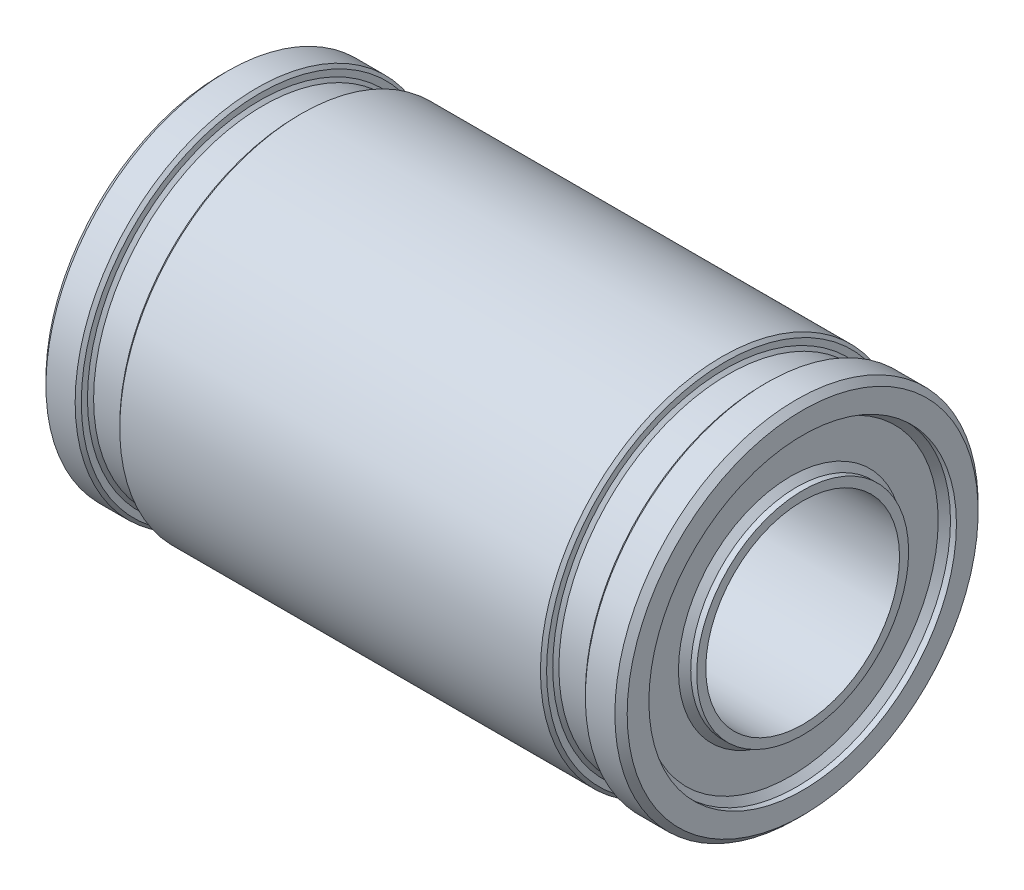
ISO-10303-21;
HEADER;
FILE_DESCRIPTION(('STEP AP214'),'2;1');
FILE_NAME('part.step','',(''),(''),'','','');
FILE_SCHEMA(('AUTOMOTIVE_DESIGN { 1 0 10303 214 1 1 1 1 }'));
ENDSEC;
DATA;
#1=APPLICATION_CONTEXT('core data for automotive mechanical design processes');
#2=APPLICATION_PROTOCOL_DEFINITION('international standard','automotive_design',2000,#1);
#3=PRODUCT_CONTEXT('',#1,'mechanical');
#4=PRODUCT('Part','Part','',(#3));
#5=PRODUCT_RELATED_PRODUCT_CATEGORY('part','',(#4));
#6=PRODUCT_DEFINITION_FORMATION('','',#4);
#7=PRODUCT_DEFINITION_CONTEXT('part definition',#1,'design');
#8=PRODUCT_DEFINITION('design','',#6,#7);
#9=PRODUCT_DEFINITION_SHAPE('','',#8);
#10=(LENGTH_UNIT() NAMED_UNIT(*) SI_UNIT(.MILLI.,.METRE.));
#11=(NAMED_UNIT(*) PLANE_ANGLE_UNIT() SI_UNIT($,.RADIAN.));
#12=(NAMED_UNIT(*) SI_UNIT($,.STERADIAN.) SOLID_ANGLE_UNIT());
#13=UNCERTAINTY_MEASURE_WITH_UNIT(LENGTH_MEASURE(1.E-05),#10,'distance_accuracy_value','');
#14=(GEOMETRIC_REPRESENTATION_CONTEXT(3) GLOBAL_UNCERTAINTY_ASSIGNED_CONTEXT((#13)) GLOBAL_UNIT_ASSIGNED_CONTEXT((#10,
#11,#12)) REPRESENTATION_CONTEXT('',''));
#15=CARTESIAN_POINT('',(0.,0.,0.));
#16=DIRECTION('',(0.,0.,1.));
#17=DIRECTION('',(1.,0.,0.));
#18=AXIS2_PLACEMENT_3D('',#15,#16,#17);
#19=CARTESIAN_POINT('',(24.,6.92500000000001,0.));
#20=DIRECTION('',(1.,0.,0.));
#21=DIRECTION('',(0.,0.,-1.));
#22=AXIS2_PLACEMENT_3D('',#19,#20,#21);
#23=PLANE('',#22);
#24=CARTESIAN_POINT('',(24.,0.,0.));
#25=DIRECTION('',(1.,0.,0.));
#26=DIRECTION('',(0.,0.,-1.));
#27=AXIS2_PLACEMENT_3D('',#24,#25,#26);
#28=CIRCLE('',#27,6.35);
#29=CARTESIAN_POINT('',(24.,0.,-6.35));
#30=VERTEX_POINT('',#29);
#31=EDGE_CURVE('E104',#30,#30,#28,.T.);
#32=ORIENTED_EDGE('',*,*,#31,.F.);
#33=EDGE_LOOP('',(#32));
#34=FACE_BOUND('',#33,.T.);
#35=CARTESIAN_POINT('',(24.0000000017015,0.,0.));
#36=DIRECTION('',(-1.,0.,0.));
#37=DIRECTION('',(0.,0.,1.));
#38=AXIS2_PLACEMENT_3D('',#35,#36,#37);
#39=CIRCLE('',#38,7.24600000170147);
#40=CARTESIAN_POINT('',(24.0000000017015,0.,7.24600000170147));
#41=VERTEX_POINT('',#40);
#42=EDGE_CURVE('E18',#41,#41,#39,.T.);
#43=ORIENTED_EDGE('',*,*,#42,.F.);
#44=EDGE_LOOP('',(#43));
#45=FACE_BOUND('',#44,.T.);
#46=ADVANCED_FACE('F15',(#34,#45),#23,.T.);
#47=CARTESIAN_POINT('',(24.0000000017015,0.,0.));
#48=DIRECTION('',(-1.,0.,0.));
#49=DIRECTION('',(0.,0.,1.));
#50=AXIS2_PLACEMENT_3D('',#47,#48,#49);
#51=CONICAL_SURFACE('',#50,7.24600000170147,0.785398150000003);
#52=ORIENTED_EDGE('',*,*,#42,.T.);
#53=EDGE_LOOP('',(#52));
#54=FACE_BOUND('',#53,.T.);
#55=CARTESIAN_POINT('',(23.746,0.,0.));
#56=DIRECTION('',(1.,0.,0.));
#57=DIRECTION('',(0.,1.,0.));
#58=AXIS2_PLACEMENT_3D('',#55,#56,#57);
#59=CIRCLE('',#58,7.5);
#60=CARTESIAN_POINT('',(23.746,7.5,0.));
#61=VERTEX_POINT('',#60);
#62=EDGE_CURVE('E99',#61,#61,#59,.F.);
#63=ORIENTED_EDGE('',*,*,#62,.F.);
#64=EDGE_LOOP('',(#63));
#65=FACE_BOUND('',#64,.T.);
#66=ADVANCED_FACE('F153',(#54,#65),#51,.T.);
#67=CARTESIAN_POINT('',(23.754,0.,0.));
#68=DIRECTION('',(1.,0.,0.));
#69=DIRECTION('',(0.,0.,-1.));
#70=AXIS2_PLACEMENT_3D('',#67,#68,#69);
#71=CYLINDRICAL_SURFACE('',#70,6.35);
#72=CARTESIAN_POINT('',(23.754,0.,0.));
#73=DIRECTION('',(1.,0.,0.));
#74=DIRECTION('',(0.,-1.,0.));
#75=AXIS2_PLACEMENT_3D('',#72,#73,#74);
#76=CIRCLE('',#75,6.35);
#77=CARTESIAN_POINT('',(23.754,-6.35,0.));
#78=VERTEX_POINT('',#77);
#79=EDGE_CURVE('E94',#78,#78,#76,.T.);
#80=ORIENTED_EDGE('',*,*,#79,.F.);
#81=EDGE_LOOP('',(#80));
#82=FACE_BOUND('',#81,.T.);
#83=ORIENTED_EDGE('',*,*,#31,.T.);
#84=EDGE_LOOP('',(#83));
#85=FACE_BOUND('',#84,.T.);
#86=ADVANCED_FACE('F164',(#82,#85),#71,.F.);
#87=CARTESIAN_POINT('',(22.5268,0.,0.));
#88=DIRECTION('',(1.,0.,0.));
#89=DIRECTION('',(0.,0.,-1.));
#90=AXIS2_PLACEMENT_3D('',#87,#88,#89);
#91=CYLINDRICAL_SURFACE('',#90,7.5);
#92=CARTESIAN_POINT('',(22.5268000008508,0.,0.));
#93=DIRECTION('',(1.,0.,0.));
#94=DIRECTION('',(0.,-1.,0.));
#95=AXIS2_PLACEMENT_3D('',#92,#93,#94);
#96=CIRCLE('',#95,7.49999999914926);
#97=CARTESIAN_POINT('',(22.5268000008508,-7.49999999914926,0.));
#98=VERTEX_POINT('',#97);
#99=EDGE_CURVE('E90',#98,#98,#96,.F.);
#100=ORIENTED_EDGE('',*,*,#99,.F.);
#101=EDGE_LOOP('',(#100));
#102=FACE_BOUND('',#101,.T.);
#103=ORIENTED_EDGE('',*,*,#62,.T.);
#104=EDGE_LOOP('',(#103));
#105=FACE_BOUND('',#104,.T.);
#106=ADVANCED_FACE('F288',(#102,#105),#91,.T.);
#107=CARTESIAN_POINT('',(23.5,0.,0.));
#108=DIRECTION('',(1.,0.,0.));
#109=DIRECTION('',(0.,0.,-1.));
#110=AXIS2_PLACEMENT_3D('',#107,#108,#109);
#111=CONICAL_SURFACE('',#110,6.096,0.785398163397453);
#112=CARTESIAN_POINT('',(23.5,0.,0.));
#113=DIRECTION('',(1.,0.,0.));
#114=DIRECTION('',(0.,0.,-1.));
#115=AXIS2_PLACEMENT_3D('',#112,#113,#114);
#116=CIRCLE('',#115,6.096);
#117=CARTESIAN_POINT('',(23.5,0.,-6.096));
#118=VERTEX_POINT('',#117);
#119=EDGE_CURVE('E93',#118,#118,#116,.T.);
#120=ORIENTED_EDGE('',*,*,#119,.F.);
#121=EDGE_LOOP('',(#120));
#122=FACE_BOUND('',#121,.T.);
#123=ORIENTED_EDGE('',*,*,#79,.T.);
#124=EDGE_LOOP('',(#123));
#125=FACE_BOUND('',#124,.T.);
#126=ADVANCED_FACE('F284',(#122,#125),#111,.F.);
#127=CARTESIAN_POINT('',(22.3997999991493,0.,0.));
#128=DIRECTION('',(1.,0.,0.));
#129=DIRECTION('',(0.,0.,-1.));
#130=AXIS2_PLACEMENT_3D('',#127,#128,#129);
#131=CONICAL_SURFACE('',#130,7.37300000085074,0.785398149999998);
#132=ORIENTED_EDGE('',*,*,#99,.T.);
#133=EDGE_LOOP('',(#132));
#134=FACE_BOUND('',#133,.T.);
#135=CARTESIAN_POINT('',(22.3997999991493,0.,0.));
#136=DIRECTION('',(1.,0.,0.));
#137=DIRECTION('',(0.,0.,-1.));
#138=AXIS2_PLACEMENT_3D('',#135,#136,#137);
#139=CIRCLE('',#138,7.37300000085074);
#140=CARTESIAN_POINT('',(22.3997999991493,0.,-7.37300000085074));
#141=VERTEX_POINT('',#140);
#142=EDGE_CURVE('E143',#141,#141,#139,.F.);
#143=ORIENTED_EDGE('',*,*,#142,.F.);
#144=EDGE_LOOP('',(#143));
#145=FACE_BOUND('',#144,.T.);
#146=ADVANCED_FACE('F280',(#134,#145),#131,.T.);
#147=CARTESIAN_POINT('',(23.5,5.36274966431095,0.));
#148=DIRECTION('',(1.,0.,0.));
#149=DIRECTION('',(0.,0.,-1.));
#150=AXIS2_PLACEMENT_3D('',#147,#148,#149);
#151=PLANE('',#150);
#152=CARTESIAN_POINT('',(23.4999999982985,0.,0.));
#153=DIRECTION('',(-1.,0.,0.));
#154=DIRECTION('',(0.,0.,1.));
#155=AXIS2_PLACEMENT_3D('',#152,#153,#154);
#156=CIRCLE('',#155,4.62949932692042);
#157=CARTESIAN_POINT('',(23.4999999982985,0.,4.62949932692042));
#158=VERTEX_POINT('',#157);
#159=EDGE_CURVE('E140',#158,#158,#156,.F.);
#160=ORIENTED_EDGE('',*,*,#159,.F.);
#161=EDGE_LOOP('',(#160));
#162=FACE_BOUND('',#161,.T.);
#163=ORIENTED_EDGE('',*,*,#119,.T.);
#164=EDGE_LOOP('',(#163));
#165=FACE_BOUND('',#164,.T.);
#166=ADVANCED_FACE('F276',(#162,#165),#151,.T.);
#167=CARTESIAN_POINT('',(22.3998,7.246,0.));
#168=DIRECTION('',(-1.,0.,0.));
#169=DIRECTION('',(0.,0.,1.));
#170=AXIS2_PLACEMENT_3D('',#167,#168,#169);
#171=PLANE('',#170);
#172=CARTESIAN_POINT('',(22.3998000008508,0.,0.));
#173=DIRECTION('',(1.,0.,0.));
#174=DIRECTION('',(0.,0.,-1.));
#175=AXIS2_PLACEMENT_3D('',#172,#173,#174);
#176=CIRCLE('',#175,7.11899999914926);
#177=CARTESIAN_POINT('',(22.3998000008508,0.,-7.11899999914926));
#178=VERTEX_POINT('',#177);
#179=EDGE_CURVE('E87',#178,#178,#176,.F.);
#180=ORIENTED_EDGE('',*,*,#179,.F.);
#181=EDGE_LOOP('',(#180));
#182=FACE_BOUND('',#181,.T.);
#183=ORIENTED_EDGE('',*,*,#142,.T.);
#184=EDGE_LOOP('',(#183));
#185=FACE_BOUND('',#184,.T.);
#186=ADVANCED_FACE('F272',(#182,#185),#171,.T.);
#187=CARTESIAN_POINT('',(23.7540000017015,0.,0.));
#188=DIRECTION('',(-1.,0.,0.));
#189=DIRECTION('',(0.,0.,1.));
#190=AXIS2_PLACEMENT_3D('',#187,#188,#189);
#191=CONICAL_SURFACE('',#190,4.37549933032337,0.785398150000001);
#192=CARTESIAN_POINT('',(23.754,0.,0.));
#193=DIRECTION('',(1.,0.,0.));
#194=DIRECTION('',(0.,1.,0.));
#195=AXIS2_PLACEMENT_3D('',#192,#193,#194);
#196=CIRCLE('',#195,4.37549932862189);
#197=CARTESIAN_POINT('',(23.754,4.37549932862189,0.));
#198=VERTEX_POINT('',#197);
#199=EDGE_CURVE('E82',#198,#198,#196,.T.);
#200=ORIENTED_EDGE('',*,*,#199,.F.);
#201=EDGE_LOOP('',(#200));
#202=FACE_BOUND('',#201,.T.);
#203=ORIENTED_EDGE('',*,*,#159,.T.);
#204=EDGE_LOOP('',(#203));
#205=FACE_BOUND('',#204,.T.);
#206=ADVANCED_FACE('F268',(#202,#205),#191,.T.);
#207=CARTESIAN_POINT('',(22.2727999991493,0.,0.));
#208=DIRECTION('',(1.,0.,0.));
#209=DIRECTION('',(0.,0.,-1.));
#210=AXIS2_PLACEMENT_3D('',#207,#208,#209);
#211=CONICAL_SURFACE('',#210,6.99200000085074,0.785398150000001);
#212=ORIENTED_EDGE('',*,*,#179,.T.);
#213=EDGE_LOOP('',(#212));
#214=FACE_BOUND('',#213,.T.);
#215=CARTESIAN_POINT('',(22.2728,0.,0.));
#216=DIRECTION('',(1.,0.,0.));
#217=DIRECTION('',(0.,1.,0.));
#218=AXIS2_PLACEMENT_3D('',#215,#216,#217);
#219=CIRCLE('',#218,6.992);
#220=CARTESIAN_POINT('',(22.2728,6.992,0.));
#221=VERTEX_POINT('',#220);
#222=EDGE_CURVE('E79',#221,#221,#219,.F.);
#223=ORIENTED_EDGE('',*,*,#222,.F.);
#224=EDGE_LOOP('',(#223));
#225=FACE_BOUND('',#224,.T.);
#226=ADVANCED_FACE('F264',(#214,#225),#211,.T.);
#227=CARTESIAN_POINT('',(23.754,0.,0.));
#228=DIRECTION('',(1.,0.,0.));
#229=DIRECTION('',(0.,0.,-1.));
#230=AXIS2_PLACEMENT_3D('',#227,#228,#229);
#231=CYLINDRICAL_SURFACE('',#230,4.37549932862189);
#232=ORIENTED_EDGE('',*,*,#199,.T.);
#233=EDGE_LOOP('',(#232));
#234=FACE_BOUND('',#233,.T.);
#235=CARTESIAN_POINT('',(24.,0.,0.));
#236=DIRECTION('',(1.,0.,0.));
#237=DIRECTION('',(0.,0.,-1.));
#238=AXIS2_PLACEMENT_3D('',#235,#236,#237);
#239=CIRCLE('',#238,4.37549932862189);
#240=CARTESIAN_POINT('',(24.,0.,-4.37549932862189));
#241=VERTEX_POINT('',#240);
#242=EDGE_CURVE('E76',#241,#241,#239,.T.);
#243=ORIENTED_EDGE('',*,*,#242,.F.);
#244=EDGE_LOOP('',(#243));
#245=FACE_BOUND('',#244,.T.);
#246=ADVANCED_FACE('F260',(#234,#245),#231,.T.);
#247=CARTESIAN_POINT('',(20.9266,0.,0.));
#248=DIRECTION('',(1.,0.,0.));
#249=DIRECTION('',(0.,0.,-1.));
#250=AXIS2_PLACEMENT_3D('',#247,#248,#249);
#251=CYLINDRICAL_SURFACE('',#250,6.992);
#252=CARTESIAN_POINT('',(20.9266000008508,0.,0.));
#253=DIRECTION('',(-1.,0.,0.));
#254=DIRECTION('',(0.,-1.,0.));
#255=AXIS2_PLACEMENT_3D('',#252,#253,#254);
#256=CIRCLE('',#255,6.99200000085073);
#257=CARTESIAN_POINT('',(20.9266000008508,-6.99200000085073,0.));
#258=VERTEX_POINT('',#257);
#259=EDGE_CURVE('E72',#258,#258,#256,.T.);
#260=ORIENTED_EDGE('',*,*,#259,.F.);
#261=EDGE_LOOP('',(#260));
#262=FACE_BOUND('',#261,.T.);
#263=ORIENTED_EDGE('',*,*,#222,.T.);
#264=EDGE_LOOP('',(#263));
#265=FACE_BOUND('',#264,.T.);
#266=ADVANCED_FACE('F256',(#262,#265),#251,.T.);
#267=CARTESIAN_POINT('',(24.,4.18774966431095,0.));
#268=DIRECTION('',(1.,0.,0.));
#269=DIRECTION('',(0.,0.,-1.));
#270=AXIS2_PLACEMENT_3D('',#267,#268,#269);
#271=PLANE('',#270);
#272=CARTESIAN_POINT('',(24.,0.,0.));
#273=DIRECTION('',(1.,0.,0.));
#274=DIRECTION('',(0.,0.,-1.));
#275=AXIS2_PLACEMENT_3D('',#272,#273,#274);
#276=CIRCLE('',#275,4.);
#277=CARTESIAN_POINT('',(24.,0.,-4.));
#278=VERTEX_POINT('',#277);
#279=EDGE_CURVE('E75',#278,#278,#276,.T.);
#280=ORIENTED_EDGE('',*,*,#279,.F.);
#281=EDGE_LOOP('',(#280));
#282=FACE_BOUND('',#281,.T.);
#283=ORIENTED_EDGE('',*,*,#242,.T.);
#284=EDGE_LOOP('',(#283));
#285=FACE_BOUND('',#284,.T.);
#286=ADVANCED_FACE('F252',(#282,#285),#271,.T.);
#287=CARTESIAN_POINT('',(20.9266000008508,0.,0.));
#288=DIRECTION('',(-1.,0.,0.));
#289=DIRECTION('',(0.,0.,1.));
#290=AXIS2_PLACEMENT_3D('',#287,#288,#289);
#291=CONICAL_SURFACE('',#290,6.99200000085073,0.785398149999991);
#292=ORIENTED_EDGE('',*,*,#259,.T.);
#293=EDGE_LOOP('',(#292));
#294=FACE_BOUND('',#293,.T.);
#295=CARTESIAN_POINT('',(20.7995999991493,0.,0.));
#296=DIRECTION('',(-1.,0.,0.));
#297=DIRECTION('',(0.,0.,1.));
#298=AXIS2_PLACEMENT_3D('',#295,#296,#297);
#299=CIRCLE('',#298,7.11899999914926);
#300=CARTESIAN_POINT('',(20.7995999991493,0.,7.11899999914926));
#301=VERTEX_POINT('',#300);
#302=EDGE_CURVE('E131',#301,#301,#299,.T.);
#303=ORIENTED_EDGE('',*,*,#302,.F.);
#304=EDGE_LOOP('',(#303));
#305=FACE_BOUND('',#304,.T.);
#306=ADVANCED_FACE('F248',(#294,#305),#291,.T.);
#307=CARTESIAN_POINT('',(0.,0.,0.));
#308=DIRECTION('',(1.,0.,0.));
#309=DIRECTION('',(0.,0.,-1.));
#310=AXIS2_PLACEMENT_3D('',#307,#308,#309);
#311=CYLINDRICAL_SURFACE('',#310,4.);
#312=ORIENTED_EDGE('',*,*,#279,.T.);
#313=EDGE_LOOP('',(#312));
#314=FACE_BOUND('',#313,.T.);
#315=CARTESIAN_POINT('',(0.,0.,0.));
#316=DIRECTION('',(1.,0.,0.));
#317=DIRECTION('',(0.,0.,-1.));
#318=AXIS2_PLACEMENT_3D('',#315,#316,#317);
#319=CIRCLE('',#318,4.);
#320=CARTESIAN_POINT('',(0.,0.,-4.));
#321=VERTEX_POINT('',#320);
#322=EDGE_CURVE('E128',#321,#321,#319,.T.);
#323=ORIENTED_EDGE('',*,*,#322,.F.);
#324=EDGE_LOOP('',(#323));
#325=FACE_BOUND('',#324,.T.);
#326=ADVANCED_FACE('F244',(#314,#325),#311,.F.);
#327=CARTESIAN_POINT('',(20.7996,7.246,0.));
#328=DIRECTION('',(1.,0.,0.));
#329=DIRECTION('',(0.,0.,-1.));
#330=AXIS2_PLACEMENT_3D('',#327,#328,#329);
#331=PLANE('',#330);
#332=ORIENTED_EDGE('',*,*,#302,.T.);
#333=EDGE_LOOP('',(#332));
#334=FACE_BOUND('',#333,.T.);
#335=CARTESIAN_POINT('',(20.7996000008508,0.,0.));
#336=DIRECTION('',(-1.,0.,0.));
#337=DIRECTION('',(0.,0.,1.));
#338=AXIS2_PLACEMENT_3D('',#335,#336,#337);
#339=CIRCLE('',#338,7.37300000085074);
#340=CARTESIAN_POINT('',(20.7996000008508,0.,7.37300000085074));
#341=VERTEX_POINT('',#340);
#342=EDGE_CURVE('E125',#341,#341,#339,.T.);
#343=ORIENTED_EDGE('',*,*,#342,.F.);
#344=EDGE_LOOP('',(#343));
#345=FACE_BOUND('',#344,.T.);
#346=ADVANCED_FACE('F240',(#334,#345),#331,.T.);
#347=CARTESIAN_POINT('',(0.,4.18774966431095,0.));
#348=DIRECTION('',(-1.,0.,0.));
#349=DIRECTION('',(0.,0.,1.));
#350=AXIS2_PLACEMENT_3D('',#347,#348,#349);
#351=PLANE('',#350);
#352=ORIENTED_EDGE('',*,*,#322,.T.);
#353=EDGE_LOOP('',(#352));
#354=FACE_BOUND('',#353,.T.);
#355=CARTESIAN_POINT('',(0.,0.,0.));
#356=DIRECTION('',(1.,0.,0.));
#357=DIRECTION('',(0.,0.,-1.));
#358=AXIS2_PLACEMENT_3D('',#355,#356,#357);
#359=CIRCLE('',#358,4.37549932862189);
#360=CARTESIAN_POINT('',(0.,0.,-4.37549932862189));
#361=VERTEX_POINT('',#360);
#362=EDGE_CURVE('E69',#361,#361,#359,.T.);
#363=ORIENTED_EDGE('',*,*,#362,.F.);
#364=EDGE_LOOP('',(#363));
#365=FACE_BOUND('',#364,.T.);
#366=ADVANCED_FACE('F236',(#354,#365),#351,.T.);
#367=CARTESIAN_POINT('',(20.7996000008508,0.,0.));
#368=DIRECTION('',(-1.,0.,0.));
#369=DIRECTION('',(0.,0.,1.));
#370=AXIS2_PLACEMENT_3D('',#367,#368,#369);
#371=CONICAL_SURFACE('',#370,7.37300000085074,0.785398149999994);
#372=ORIENTED_EDGE('',*,*,#342,.T.);
#373=EDGE_LOOP('',(#372));
#374=FACE_BOUND('',#373,.T.);
#375=CARTESIAN_POINT('',(20.6726,0.,0.));
#376=DIRECTION('',(1.,0.,0.));
#377=DIRECTION('',(0.,1.,0.));
#378=AXIS2_PLACEMENT_3D('',#375,#376,#377);
#379=CIRCLE('',#378,7.5);
#380=CARTESIAN_POINT('',(20.6726,7.5,0.));
#381=VERTEX_POINT('',#380);
#382=EDGE_CURVE('E64',#381,#381,#379,.F.);
#383=ORIENTED_EDGE('',*,*,#382,.F.);
#384=EDGE_LOOP('',(#383));
#385=FACE_BOUND('',#384,.T.);
#386=ADVANCED_FACE('F232',(#374,#385),#371,.T.);
#387=CARTESIAN_POINT('',(0.,0.,0.));
#388=DIRECTION('',(1.,0.,0.));
#389=DIRECTION('',(0.,0.,-1.));
#390=AXIS2_PLACEMENT_3D('',#387,#388,#389);
#391=CYLINDRICAL_SURFACE('',#390,4.37549932862189);
#392=CARTESIAN_POINT('',(0.256329418975003,0.,0.));
#393=DIRECTION('',(1.,0.,0.));
#394=DIRECTION('',(0.,-1.,0.));
#395=AXIS2_PLACEMENT_3D('',#392,#393,#394);
#396=CIRCLE('',#395,4.37549933032337);
#397=CARTESIAN_POINT('',(0.256329418975003,-4.37549933032337,0.));
#398=VERTEX_POINT('',#397);
#399=EDGE_CURVE('E59',#398,#398,#396,.T.);
#400=ORIENTED_EDGE('',*,*,#399,.F.);
#401=EDGE_LOOP('',(#400));
#402=FACE_BOUND('',#401,.T.);
#403=ORIENTED_EDGE('',*,*,#362,.T.);
#404=EDGE_LOOP('',(#403));
#405=FACE_BOUND('',#404,.T.);
#406=ADVANCED_FACE('F228',(#402,#405),#391,.T.);
#407=CARTESIAN_POINT('',(3.302,0.,0.));
#408=DIRECTION('',(1.,0.,0.));
#409=DIRECTION('',(0.,0.,-1.));
#410=AXIS2_PLACEMENT_3D('',#407,#408,#409);
#411=CYLINDRICAL_SURFACE('',#410,7.5);
#412=ORIENTED_EDGE('',*,*,#382,.T.);
#413=EDGE_LOOP('',(#412));
#414=FACE_BOUND('',#413,.T.);
#415=CARTESIAN_POINT('',(3.30200000085074,0.,0.));
#416=DIRECTION('',(1.,0.,0.));
#417=DIRECTION('',(0.,-1.,0.));
#418=AXIS2_PLACEMENT_3D('',#415,#416,#417);
#419=CIRCLE('',#418,7.49999999914926);
#420=CARTESIAN_POINT('',(3.30200000085074,-7.49999999914926,0.));
#421=VERTEX_POINT('',#420);
#422=EDGE_CURVE('E55',#421,#421,#419,.F.);
#423=ORIENTED_EDGE('',*,*,#422,.F.);
#424=EDGE_LOOP('',(#423));
#425=FACE_BOUND('',#424,.T.);
#426=ADVANCED_FACE('F224',(#414,#425),#411,.T.);
#427=CARTESIAN_POINT('',(0.256329418975004,0.,0.));
#428=DIRECTION('',(1.,0.,0.));
#429=DIRECTION('',(0.,0.,-1.));
#430=AXIS2_PLACEMENT_3D('',#427,#428,#429);
#431=CONICAL_SURFACE('',#430,4.37549933032337,0.78539815);
#432=CARTESIAN_POINT('',(0.510329422377955,0.,0.));
#433=DIRECTION('',(1.,0.,0.));
#434=DIRECTION('',(0.,0.,-1.));
#435=AXIS2_PLACEMENT_3D('',#432,#433,#434);
#436=CIRCLE('',#435,4.62949932692042);
#437=CARTESIAN_POINT('',(0.510329422377955,0.,-4.62949932692042));
#438=VERTEX_POINT('',#437);
#439=EDGE_CURVE('E58',#438,#438,#436,.T.);
#440=ORIENTED_EDGE('',*,*,#439,.F.);
#441=EDGE_LOOP('',(#440));
#442=FACE_BOUND('',#441,.T.);
#443=ORIENTED_EDGE('',*,*,#399,.T.);
#444=EDGE_LOOP('',(#443));
#445=FACE_BOUND('',#444,.T.);
#446=ADVANCED_FACE('F220',(#442,#445),#431,.T.);
#447=CARTESIAN_POINT('',(3.17499999914926,0.,0.));
#448=DIRECTION('',(1.,0.,0.));
#449=DIRECTION('',(0.,0.,-1.));
#450=AXIS2_PLACEMENT_3D('',#447,#448,#449);
#451=CONICAL_SURFACE('',#450,7.37300000085074,0.785398149999998);
#452=ORIENTED_EDGE('',*,*,#422,.T.);
#453=EDGE_LOOP('',(#452));
#454=FACE_BOUND('',#453,.T.);
#455=CARTESIAN_POINT('',(3.17499999914926,0.,0.));
#456=DIRECTION('',(1.,0.,0.));
#457=DIRECTION('',(0.,0.,-1.));
#458=AXIS2_PLACEMENT_3D('',#455,#456,#457);
#459=CIRCLE('',#458,7.37300000085074);
#460=CARTESIAN_POINT('',(3.17499999914926,0.,-7.37300000085074));
#461=VERTEX_POINT('',#460);
#462=EDGE_CURVE('E118',#461,#461,#459,.F.);
#463=ORIENTED_EDGE('',*,*,#462,.F.);
#464=EDGE_LOOP('',(#463));
#465=FACE_BOUND('',#464,.T.);
#466=ADVANCED_FACE('F216',(#454,#465),#451,.T.);
#467=CARTESIAN_POINT('',(0.510329420676478,5.36274966431095,0.));
#468=DIRECTION('',(-1.,0.,0.));
#469=DIRECTION('',(0.,0.,1.));
#470=AXIS2_PLACEMENT_3D('',#467,#468,#469);
#471=PLANE('',#470);
#472=ORIENTED_EDGE('',*,*,#439,.T.);
#473=EDGE_LOOP('',(#472));
#474=FACE_BOUND('',#473,.T.);
#475=CARTESIAN_POINT('',(0.510329420676478,0.,0.));
#476=DIRECTION('',(-1.,0.,0.));
#477=DIRECTION('',(0.,0.,1.));
#478=AXIS2_PLACEMENT_3D('',#475,#476,#477);
#479=CIRCLE('',#478,6.096);
#480=CARTESIAN_POINT('',(0.510329420676478,0.,6.096));
#481=VERTEX_POINT('',#480);
#482=EDGE_CURVE('E115',#481,#481,#479,.F.);
#483=ORIENTED_EDGE('',*,*,#482,.F.);
#484=EDGE_LOOP('',(#483));
#485=FACE_BOUND('',#484,.T.);
#486=ADVANCED_FACE('F212',(#474,#485),#471,.T.);
#487=CARTESIAN_POINT('',(3.175,7.246,0.));
#488=DIRECTION('',(-1.,0.,0.));
#489=DIRECTION('',(0.,0.,1.));
#490=AXIS2_PLACEMENT_3D('',#487,#488,#489);
#491=PLANE('',#490);
#492=CARTESIAN_POINT('',(3.17500000085074,0.,0.));
#493=DIRECTION('',(1.,0.,0.));
#494=DIRECTION('',(0.,0.,-1.));
#495=AXIS2_PLACEMENT_3D('',#492,#493,#494);
#496=CIRCLE('',#495,7.11899999914926);
#497=CARTESIAN_POINT('',(3.17500000085074,0.,-7.11899999914926));
#498=VERTEX_POINT('',#497);
#499=EDGE_CURVE('E52',#498,#498,#496,.F.);
#500=ORIENTED_EDGE('',*,*,#499,.F.);
#501=EDGE_LOOP('',(#500));
#502=FACE_BOUND('',#501,.T.);
#503=ORIENTED_EDGE('',*,*,#462,.T.);
#504=EDGE_LOOP('',(#503));
#505=FACE_BOUND('',#504,.T.);
#506=ADVANCED_FACE('F208',(#502,#505),#491,.T.);
#507=CARTESIAN_POINT('',(0.510329420676478,0.,0.));
#508=DIRECTION('',(-1.,0.,0.));
#509=DIRECTION('',(0.,0.,1.));
#510=AXIS2_PLACEMENT_3D('',#507,#508,#509);
#511=CONICAL_SURFACE('',#510,6.096,0.785398163397449);
#512=CARTESIAN_POINT('',(0.256329420676478,0.,0.));
#513=DIRECTION('',(1.,0.,0.));
#514=DIRECTION('',(0.,1.,0.));
#515=AXIS2_PLACEMENT_3D('',#512,#513,#514);
#516=CIRCLE('',#515,6.35);
#517=CARTESIAN_POINT('',(0.256329420676478,6.35,0.));
#518=VERTEX_POINT('',#517);
#519=EDGE_CURVE('E47',#518,#518,#516,.T.);
#520=ORIENTED_EDGE('',*,*,#519,.F.);
#521=EDGE_LOOP('',(#520));
#522=FACE_BOUND('',#521,.T.);
#523=ORIENTED_EDGE('',*,*,#482,.T.);
#524=EDGE_LOOP('',(#523));
#525=FACE_BOUND('',#524,.T.);
#526=ADVANCED_FACE('F204',(#522,#525),#511,.F.);
#527=CARTESIAN_POINT('',(3.04799999914927,0.,0.));
#528=DIRECTION('',(1.,0.,0.));
#529=DIRECTION('',(0.,0.,-1.));
#530=AXIS2_PLACEMENT_3D('',#527,#528,#529);
#531=CONICAL_SURFACE('',#530,6.99200000085074,0.785398150000001);
#532=ORIENTED_EDGE('',*,*,#499,.T.);
#533=EDGE_LOOP('',(#532));
#534=FACE_BOUND('',#533,.T.);
#535=CARTESIAN_POINT('',(3.048,0.,0.));
#536=DIRECTION('',(1.,0.,0.));
#537=DIRECTION('',(0.,1.,0.));
#538=AXIS2_PLACEMENT_3D('',#535,#536,#537);
#539=CIRCLE('',#538,6.992);
#540=CARTESIAN_POINT('',(3.048,6.992,0.));
#541=VERTEX_POINT('',#540);
#542=EDGE_CURVE('E44',#541,#541,#539,.F.);
#543=ORIENTED_EDGE('',*,*,#542,.F.);
#544=EDGE_LOOP('',(#543));
#545=FACE_BOUND('',#544,.T.);
#546=ADVANCED_FACE('F200',(#534,#545),#531,.T.);
#547=CARTESIAN_POINT('',(0.,0.,0.));
#548=DIRECTION('',(1.,0.,0.));
#549=DIRECTION('',(0.,0.,-1.));
#550=AXIS2_PLACEMENT_3D('',#547,#548,#549);
#551=CYLINDRICAL_SURFACE('',#550,6.35);
#552=ORIENTED_EDGE('',*,*,#519,.T.);
#553=EDGE_LOOP('',(#552));
#554=FACE_BOUND('',#553,.T.);
#555=CARTESIAN_POINT('',(0.,0.,0.));
#556=DIRECTION('',(1.,0.,0.));
#557=DIRECTION('',(0.,0.,-1.));
#558=AXIS2_PLACEMENT_3D('',#555,#556,#557);
#559=CIRCLE('',#558,6.35);
#560=CARTESIAN_POINT('',(0.,0.,-6.35));
#561=VERTEX_POINT('',#560);
#562=EDGE_CURVE('E41',#561,#561,#559,.T.);
#563=ORIENTED_EDGE('',*,*,#562,.F.);
#564=EDGE_LOOP('',(#563));
#565=FACE_BOUND('',#564,.T.);
#566=ADVANCED_FACE('F196',(#554,#565),#551,.F.);
#567=CARTESIAN_POINT('',(1.7145,0.,0.));
#568=DIRECTION('',(1.,0.,0.));
#569=DIRECTION('',(0.,0.,-1.));
#570=AXIS2_PLACEMENT_3D('',#567,#568,#569);
#571=CYLINDRICAL_SURFACE('',#570,6.992);
#572=CARTESIAN_POINT('',(1.71450000085074,0.,0.));
#573=DIRECTION('',(-1.,0.,0.));
#574=DIRECTION('',(0.,-1.,0.));
#575=AXIS2_PLACEMENT_3D('',#572,#573,#574);
#576=CIRCLE('',#575,6.99200000085073);
#577=CARTESIAN_POINT('',(1.71450000085074,-6.99200000085073,0.));
#578=VERTEX_POINT('',#577);
#579=EDGE_CURVE('E37',#578,#578,#576,.T.);
#580=ORIENTED_EDGE('',*,*,#579,.F.);
#581=EDGE_LOOP('',(#580));
#582=FACE_BOUND('',#581,.T.);
#583=ORIENTED_EDGE('',*,*,#542,.T.);
#584=EDGE_LOOP('',(#583));
#585=FACE_BOUND('',#584,.T.);
#586=ADVANCED_FACE('F192',(#582,#585),#571,.T.);
#587=CARTESIAN_POINT('',(0.,6.92500000000001,0.));
#588=DIRECTION('',(-1.,0.,0.));
#589=DIRECTION('',(0.,0.,1.));
#590=AXIS2_PLACEMENT_3D('',#587,#588,#589);
#591=PLANE('',#590);
#592=ORIENTED_EDGE('',*,*,#562,.T.);
#593=EDGE_LOOP('',(#592));
#594=FACE_BOUND('',#593,.T.);
#595=CARTESIAN_POINT('',(-1.70147576583624E-09,0.,0.));
#596=DIRECTION('',(1.,0.,0.));
#597=DIRECTION('',(0.,0.,-1.));
#598=AXIS2_PLACEMENT_3D('',#595,#596,#597);
#599=CIRCLE('',#598,7.24600000170147);
#600=CARTESIAN_POINT('',(-1.70147576583624E-09,0.,-7.24600000170147));
#601=VERTEX_POINT('',#600);
#602=EDGE_CURVE('E40',#601,#601,#599,.T.);
#603=ORIENTED_EDGE('',*,*,#602,.F.);
#604=EDGE_LOOP('',(#603));
#605=FACE_BOUND('',#604,.T.);
#606=ADVANCED_FACE('F188',(#594,#605),#591,.T.);
#607=CARTESIAN_POINT('',(1.71450000085074,0.,0.));
#608=DIRECTION('',(-1.,0.,0.));
#609=DIRECTION('',(0.,0.,1.));
#610=AXIS2_PLACEMENT_3D('',#607,#608,#609);
#611=CONICAL_SURFACE('',#610,6.99200000085074,0.785398150000001);
#612=ORIENTED_EDGE('',*,*,#579,.T.);
#613=EDGE_LOOP('',(#612));
#614=FACE_BOUND('',#613,.T.);
#615=CARTESIAN_POINT('',(1.58749999914926,0.,0.));
#616=DIRECTION('',(-1.,0.,0.));
#617=DIRECTION('',(0.,0.,1.));
#618=AXIS2_PLACEMENT_3D('',#615,#616,#617);
#619=CIRCLE('',#618,7.11899999914926);
#620=CARTESIAN_POINT('',(1.58749999914926,0.,7.11899999914926));
#621=VERTEX_POINT('',#620);
#622=EDGE_CURVE('E34',#621,#621,#619,.T.);
#623=ORIENTED_EDGE('',*,*,#622,.F.);
#624=EDGE_LOOP('',(#623));
#625=FACE_BOUND('',#624,.T.);
#626=ADVANCED_FACE('F184',(#614,#625),#611,.T.);
#627=CARTESIAN_POINT('',(-1.70147576583624E-09,0.,0.));
#628=DIRECTION('',(1.,0.,0.));
#629=DIRECTION('',(0.,0.,-1.));
#630=AXIS2_PLACEMENT_3D('',#627,#628,#629);
#631=CONICAL_SURFACE('',#630,7.24600000170147,0.78539815);
#632=CARTESIAN_POINT('',(0.254000000000001,0.,0.));
#633=DIRECTION('',(1.,0.,0.));
#634=DIRECTION('',(0.,1.,0.));
#635=AXIS2_PLACEMENT_3D('',#632,#633,#634);
#636=CIRCLE('',#635,7.5);
#637=CARTESIAN_POINT('',(0.254000000000001,7.5,0.));
#638=VERTEX_POINT('',#637);
#639=EDGE_CURVE('E27',#638,#638,#636,.T.);
#640=ORIENTED_EDGE('',*,*,#639,.F.);
#641=EDGE_LOOP('',(#640));
#642=FACE_BOUND('',#641,.T.);
#643=ORIENTED_EDGE('',*,*,#602,.T.);
#644=EDGE_LOOP('',(#643));
#645=FACE_BOUND('',#644,.T.);
#646=ADVANCED_FACE('F180',(#642,#645),#631,.T.);
#647=CARTESIAN_POINT('',(1.5875,7.246,0.));
#648=DIRECTION('',(1.,0.,0.));
#649=DIRECTION('',(0.,0.,-1.));
#650=AXIS2_PLACEMENT_3D('',#647,#648,#649);
#651=PLANE('',#650);
#652=ORIENTED_EDGE('',*,*,#622,.T.);
#653=EDGE_LOOP('',(#652));
#654=FACE_BOUND('',#653,.T.);
#655=CARTESIAN_POINT('',(1.58750000085074,0.,0.));
#656=DIRECTION('',(-1.,0.,0.));
#657=DIRECTION('',(0.,0.,1.));
#658=AXIS2_PLACEMENT_3D('',#655,#656,#657);
#659=CIRCLE('',#658,7.37300000085073);
#660=CARTESIAN_POINT('',(1.58750000085074,0.,7.37300000085073));
#661=VERTEX_POINT('',#660);
#662=EDGE_CURVE('E22',#661,#661,#659,.T.);
#663=ORIENTED_EDGE('',*,*,#662,.F.);
#664=EDGE_LOOP('',(#663));
#665=FACE_BOUND('',#664,.T.);
#666=ADVANCED_FACE('F173',(#654,#665),#651,.T.);
#667=CARTESIAN_POINT('',(0.254000000000001,0.,0.));
#668=DIRECTION('',(1.,0.,0.));
#669=DIRECTION('',(0.,0.,-1.));
#670=AXIS2_PLACEMENT_3D('',#667,#668,#669);
#671=CYLINDRICAL_SURFACE('',#670,7.5);
#672=CARTESIAN_POINT('',(1.46049999914926,0.,0.));
#673=DIRECTION('',(-1.,0.,0.));
#674=DIRECTION('',(0.,-1.,0.));
#675=AXIS2_PLACEMENT_3D('',#672,#673,#674);
#676=CIRCLE('',#675,7.49999999914926);
#677=CARTESIAN_POINT('',(1.46049999914926,-7.49999999914926,0.));
#678=VERTEX_POINT('',#677);
#679=EDGE_CURVE('E10',#678,#678,#676,.F.);
#680=ORIENTED_EDGE('',*,*,#679,.F.);
#681=EDGE_LOOP('',(#680));
#682=FACE_BOUND('',#681,.T.);
#683=ORIENTED_EDGE('',*,*,#639,.T.);
#684=EDGE_LOOP('',(#683));
#685=FACE_BOUND('',#684,.T.);
#686=ADVANCED_FACE('F167',(#682,#685),#671,.T.);
#687=CARTESIAN_POINT('',(1.58750000085074,0.,0.));
#688=DIRECTION('',(-1.,0.,0.));
#689=DIRECTION('',(0.,0.,1.));
#690=AXIS2_PLACEMENT_3D('',#687,#688,#689);
#691=CONICAL_SURFACE('',#690,7.37300000085074,0.785398150000001);
#692=ORIENTED_EDGE('',*,*,#679,.T.);
#693=EDGE_LOOP('',(#692));
#694=FACE_BOUND('',#693,.T.);
#695=ORIENTED_EDGE('',*,*,#662,.T.);
#696=EDGE_LOOP('',(#695));
#697=FACE_BOUND('',#696,.T.);
#698=ADVANCED_FACE('F165',(#694,#697),#691,.T.);
#699=CLOSED_SHELL('',(#46,#66,#86,#106,#126,#146,#166,#186,#206,#226,#246,#266,#286,#306,#326,
#346,#366,#386,#406,#426,#446,#466,#486,#506,#526,#546,#566,#586,#606,#626,#646,#666,#686,#698));
#700=MANIFOLD_SOLID_BREP('B1',#699);
#701=ADVANCED_BREP_SHAPE_REPRESENTATION('',(#18,#700),#14);
#702=SHAPE_DEFINITION_REPRESENTATION(#9,#701);
ENDSEC;
END-ISO-10303-21;
